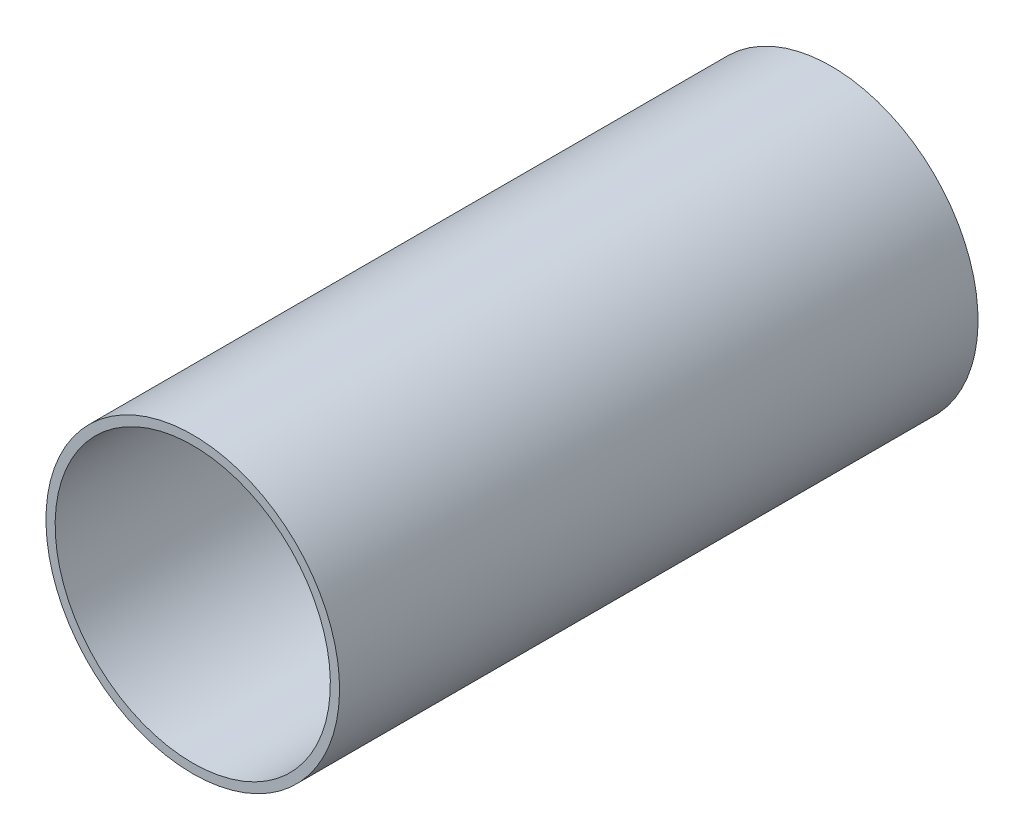
ISO-10303-21;
HEADER;
FILE_DESCRIPTION(('STEP AP214'),'2;1');
FILE_NAME('part.step','',(''),(''),'','','');
FILE_SCHEMA(('AUTOMOTIVE_DESIGN { 1 0 10303 214 1 1 1 1 }'));
ENDSEC;
DATA;
#1=APPLICATION_CONTEXT('core data for automotive mechanical design processes');
#2=APPLICATION_PROTOCOL_DEFINITION('international standard','automotive_design',2000,#1);
#3=PRODUCT_CONTEXT('',#1,'mechanical');
#4=PRODUCT('Part','Part','',(#3));
#5=PRODUCT_RELATED_PRODUCT_CATEGORY('part','',(#4));
#6=PRODUCT_DEFINITION_FORMATION('','',#4);
#7=PRODUCT_DEFINITION_CONTEXT('part definition',#1,'design');
#8=PRODUCT_DEFINITION('design','',#6,#7);
#9=PRODUCT_DEFINITION_SHAPE('','',#8);
#10=(LENGTH_UNIT() NAMED_UNIT(*) SI_UNIT(.MILLI.,.METRE.));
#11=(NAMED_UNIT(*) PLANE_ANGLE_UNIT() SI_UNIT($,.RADIAN.));
#12=(NAMED_UNIT(*) SI_UNIT($,.STERADIAN.) SOLID_ANGLE_UNIT());
#13=UNCERTAINTY_MEASURE_WITH_UNIT(LENGTH_MEASURE(1.E-05),#10,'distance_accuracy_value','');
#14=(GEOMETRIC_REPRESENTATION_CONTEXT(3) GLOBAL_UNCERTAINTY_ASSIGNED_CONTEXT((#13)) GLOBAL_UNIT_ASSIGNED_CONTEXT((#10,
#11,#12)) REPRESENTATION_CONTEXT('',''));
#15=CARTESIAN_POINT('',(0.,0.,0.));
#16=DIRECTION('',(0.,0.,1.));
#17=DIRECTION('',(1.,0.,0.));
#18=AXIS2_PLACEMENT_3D('',#15,#16,#17);
#19=CARTESIAN_POINT('',(149.86,-103.632,-0.045));
#20=DIRECTION('',(0.,0.,-1.));
#21=DIRECTION('',(0.,-1.,0.));
#22=AXIS2_PLACEMENT_3D('',#19,#20,#21);
#23=CYLINDRICAL_SURFACE('',#22,0.375);
#24=CARTESIAN_POINT('',(149.86,-103.632,-0.035));
#25=DIRECTION('',(0.,0.,-1.));
#26=DIRECTION('',(0.,-1.,0.));
#27=AXIS2_PLACEMENT_3D('',#24,#25,#26);
#28=CIRCLE('',#27,0.375);
#29=CARTESIAN_POINT('',(149.86,-104.007,-0.035));
#30=VERTEX_POINT('',#29);
#31=EDGE_CURVE('E64',#30,#30,#28,.T.);
#32=ORIENTED_EDGE('',*,*,#31,.T.);
#33=DIRECTION('',(0.,0.,1.));
#34=VECTOR('',#33,1.);
#35=CARTESIAN_POINT('',(149.86,-104.007,-0.045));
#36=LINE('',#35,#34);
#37=CARTESIAN_POINT('',(149.86,-104.007,1.705));
#38=VERTEX_POINT('',#37);
#39=EDGE_CURVE('E11',#30,#38,#36,.T.);
#40=ORIENTED_EDGE('',*,*,#39,.T.);
#41=CARTESIAN_POINT('',(149.86,-103.632,1.705));
#42=DIRECTION('',(0.,0.,-1.));
#43=DIRECTION('',(0.,-1.,0.));
#44=AXIS2_PLACEMENT_3D('',#41,#42,#43);
#45=CIRCLE('',#44,0.375);
#46=EDGE_CURVE('E25',#38,#38,#45,.T.);
#47=ORIENTED_EDGE('',*,*,#46,.F.);
#48=ORIENTED_EDGE('',*,*,#39,.F.);
#49=EDGE_LOOP('',(#32,#40,#47,#48));
#50=FACE_BOUND('',#49,.T.);
#51=ADVANCED_FACE('F17',(#50),#23,.F.);
#52=CARTESIAN_POINT('',(149.86,-104.032,1.705));
#53=DIRECTION('',(0.,0.,1.));
#54=DIRECTION('',(1.,0.,0.));
#55=AXIS2_PLACEMENT_3D('',#52,#53,#54);
#56=PLANE('',#55);
#57=ORIENTED_EDGE('',*,*,#46,.T.);
#58=EDGE_LOOP('',(#57));
#59=FACE_BOUND('',#58,.T.);
#60=CARTESIAN_POINT('',(149.86,-103.632,1.705));
#61=DIRECTION('',(0.,0.,1.));
#62=DIRECTION('',(0.,-1.,0.));
#63=AXIS2_PLACEMENT_3D('',#60,#61,#62);
#64=CIRCLE('',#63,0.4);
#65=CARTESIAN_POINT('',(149.86,-104.032,1.705));
#66=VERTEX_POINT('',#65);
#67=EDGE_CURVE('E56',#66,#66,#64,.T.);
#68=ORIENTED_EDGE('',*,*,#67,.T.);
#69=EDGE_LOOP('',(#68));
#70=FACE_BOUND('',#69,.T.);
#71=ADVANCED_FACE('F73',(#59,#70),#56,.T.);
#72=CARTESIAN_POINT('',(149.86,-104.032,-0.035));
#73=DIRECTION('',(0.,0.,1.));
#74=DIRECTION('',(1.,0.,0.));
#75=AXIS2_PLACEMENT_3D('',#72,#73,#74);
#76=PLANE('',#75);
#77=ORIENTED_EDGE('',*,*,#31,.F.);
#78=EDGE_LOOP('',(#77));
#79=FACE_BOUND('',#78,.T.);
#80=CARTESIAN_POINT('',(149.86,-103.632,-0.035));
#81=DIRECTION('',(0.,0.,1.));
#82=DIRECTION('',(0.,-1.,0.));
#83=AXIS2_PLACEMENT_3D('',#80,#81,#82);
#84=CIRCLE('',#83,0.4);
#85=CARTESIAN_POINT('',(149.86,-104.032,-0.035));
#86=VERTEX_POINT('',#85);
#87=EDGE_CURVE('E55',#86,#86,#84,.T.);
#88=ORIENTED_EDGE('',*,*,#87,.F.);
#89=EDGE_LOOP('',(#88));
#90=FACE_BOUND('',#89,.T.);
#91=ADVANCED_FACE('F82',(#79,#90),#76,.F.);
#92=CARTESIAN_POINT('',(149.86,-103.632,-0.035));
#93=DIRECTION('',(0.,0.,-1.));
#94=DIRECTION('',(0.,-1.,0.));
#95=AXIS2_PLACEMENT_3D('',#92,#93,#94);
#96=CYLINDRICAL_SURFACE('',#95,0.4);
#97=ORIENTED_EDGE('',*,*,#87,.T.);
#98=DIRECTION('',(0.,0.,1.));
#99=VECTOR('',#98,1.);
#100=CARTESIAN_POINT('',(149.86,-104.032,-0.035));
#101=LINE('',#100,#99);
#102=EDGE_CURVE('E52',#86,#66,#101,.T.);
#103=ORIENTED_EDGE('',*,*,#102,.T.);
#104=ORIENTED_EDGE('',*,*,#67,.F.);
#105=ORIENTED_EDGE('',*,*,#102,.F.);
#106=EDGE_LOOP('',(#97,#103,#104,#105));
#107=FACE_BOUND('',#106,.T.);
#108=ADVANCED_FACE('F53',(#107),#96,.T.);
#109=CLOSED_SHELL('',(#51,#71,#91,#108));
#110=MANIFOLD_SOLID_BREP('B1',#109);
#111=ADVANCED_BREP_SHAPE_REPRESENTATION('',(#18,#110),#14);
#112=SHAPE_DEFINITION_REPRESENTATION(#9,#111);
ENDSEC;
END-ISO-10303-21;
